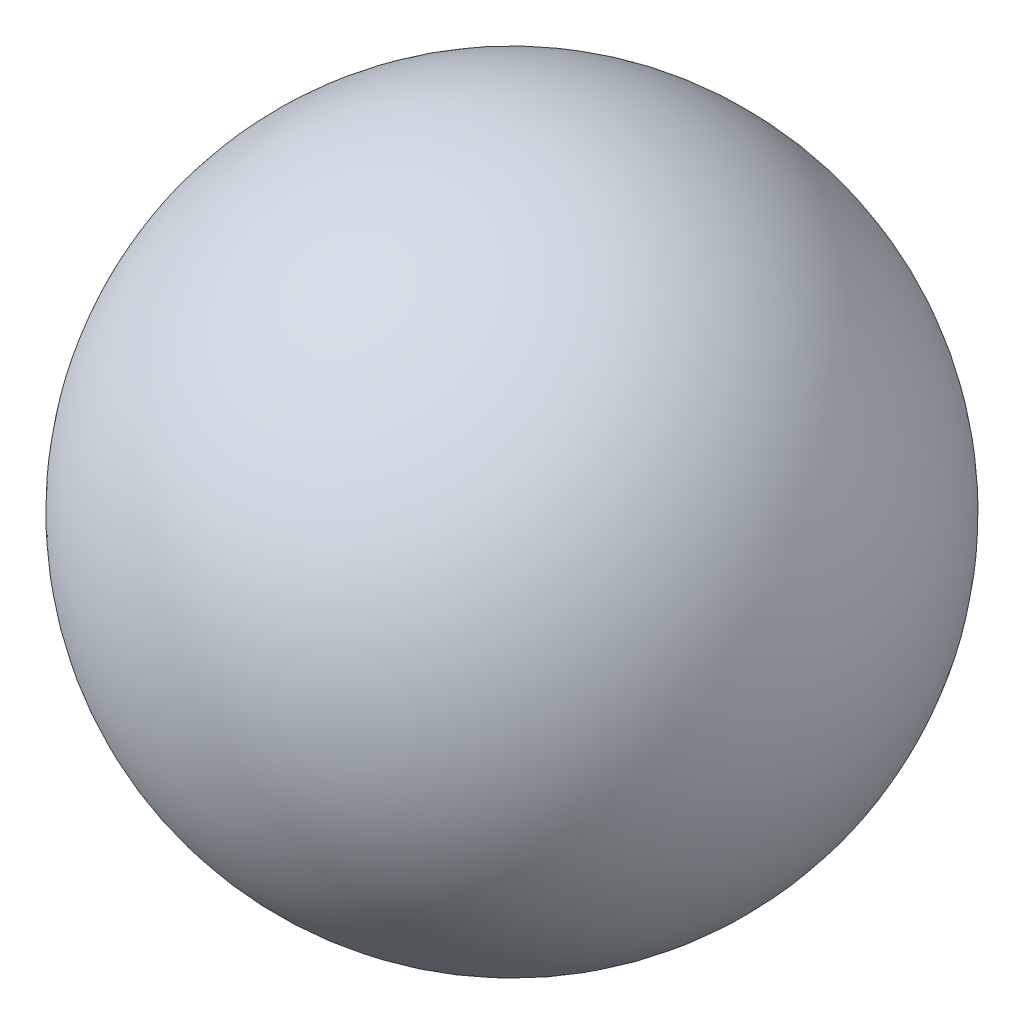
ISO-10303-21;
HEADER;
FILE_DESCRIPTION(('STEP AP214'),'2;1');
FILE_NAME('part.step','',(''),(''),'','','');
FILE_SCHEMA(('AUTOMOTIVE_DESIGN { 1 0 10303 214 1 1 1 1 }'));
ENDSEC;
DATA;
#1=APPLICATION_CONTEXT('core data for automotive mechanical design processes');
#2=APPLICATION_PROTOCOL_DEFINITION('international standard','automotive_design',2000,#1);
#3=PRODUCT_CONTEXT('',#1,'mechanical');
#4=PRODUCT('Part','Part','',(#3));
#5=PRODUCT_RELATED_PRODUCT_CATEGORY('part','',(#4));
#6=PRODUCT_DEFINITION_FORMATION('','',#4);
#7=PRODUCT_DEFINITION_CONTEXT('part definition',#1,'design');
#8=PRODUCT_DEFINITION('design','',#6,#7);
#9=PRODUCT_DEFINITION_SHAPE('','',#8);
#10=(LENGTH_UNIT() NAMED_UNIT(*) SI_UNIT(.MILLI.,.METRE.));
#11=(NAMED_UNIT(*) PLANE_ANGLE_UNIT() SI_UNIT($,.RADIAN.));
#12=(NAMED_UNIT(*) SI_UNIT($,.STERADIAN.) SOLID_ANGLE_UNIT());
#13=UNCERTAINTY_MEASURE_WITH_UNIT(LENGTH_MEASURE(1.E-05),#10,'distance_accuracy_value','');
#14=(GEOMETRIC_REPRESENTATION_CONTEXT(3) GLOBAL_UNCERTAINTY_ASSIGNED_CONTEXT((#13)) GLOBAL_UNIT_ASSIGNED_CONTEXT((#10,
#11,#12)) REPRESENTATION_CONTEXT('',''));
#15=CARTESIAN_POINT('',(0.,0.,0.));
#16=DIRECTION('',(0.,0.,1.));
#17=DIRECTION('',(1.,0.,0.));
#18=AXIS2_PLACEMENT_3D('',#15,#16,#17);
#19=CARTESIAN_POINT('',(0.,0.,0.));
#20=DIRECTION('',(-1.,0.,0.));
#21=DIRECTION('',(0.,1.,0.));
#22=AXIS2_PLACEMENT_3D('',#19,#20,#21);
#23=SPHERICAL_SURFACE('',#22,75.);
#24=CARTESIAN_POINT('',(-75.,0.,0.));
#25=VERTEX_POINT('',#24);
#26=VERTEX_LOOP('',#25);
#27=FACE_BOUND('',#26,.T.);
#28=ADVANCED_FACE('F34',(#27),#23,.T.);
#29=CLOSED_SHELL('',(#28));
#30=MANIFOLD_SOLID_BREP('B2',#29);
#31=ADVANCED_BREP_SHAPE_REPRESENTATION('',(#18,#30),#14);
#32=SHAPE_DEFINITION_REPRESENTATION(#9,#31);
ENDSEC;
END-ISO-10303-21;
